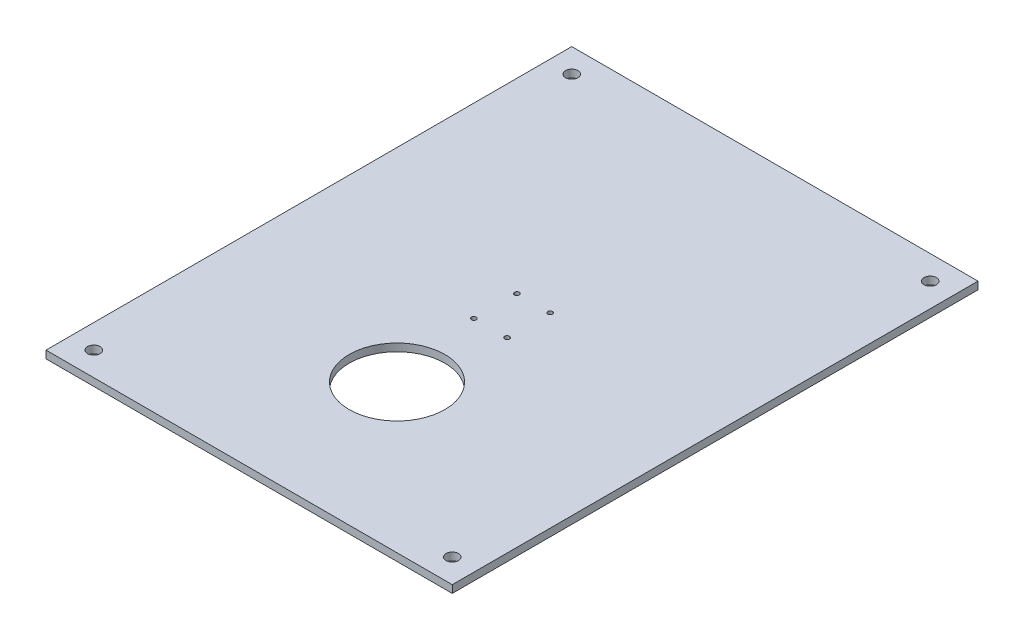
ISO-10303-21;
HEADER;
FILE_DESCRIPTION(('STEP AP214'),'2;1');
FILE_NAME('part.step','',(''),(''),'','','');
FILE_SCHEMA(('AUTOMOTIVE_DESIGN { 1 0 10303 214 1 1 1 1 }'));
ENDSEC;
DATA;
#1=APPLICATION_CONTEXT('core data for automotive mechanical design processes');
#2=APPLICATION_PROTOCOL_DEFINITION('international standard','automotive_design',2000,#1);
#3=PRODUCT_CONTEXT('',#1,'mechanical');
#4=PRODUCT('Part','Part','',(#3));
#5=PRODUCT_RELATED_PRODUCT_CATEGORY('part','',(#4));
#6=PRODUCT_DEFINITION_FORMATION('','',#4);
#7=PRODUCT_DEFINITION_CONTEXT('part definition',#1,'design');
#8=PRODUCT_DEFINITION('design','',#6,#7);
#9=PRODUCT_DEFINITION_SHAPE('','',#8);
#10=(LENGTH_UNIT() NAMED_UNIT(*) SI_UNIT(.MILLI.,.METRE.));
#11=(NAMED_UNIT(*) PLANE_ANGLE_UNIT() SI_UNIT($,.RADIAN.));
#12=(NAMED_UNIT(*) SI_UNIT($,.STERADIAN.) SOLID_ANGLE_UNIT());
#13=UNCERTAINTY_MEASURE_WITH_UNIT(LENGTH_MEASURE(1.E-05),#10,'distance_accuracy_value','');
#14=(GEOMETRIC_REPRESENTATION_CONTEXT(3) GLOBAL_UNCERTAINTY_ASSIGNED_CONTEXT((#13)) GLOBAL_UNIT_ASSIGNED_CONTEXT((#10,
#11,#12)) REPRESENTATION_CONTEXT('',''));
#15=CARTESIAN_POINT('',(0.,0.,0.));
#16=DIRECTION('',(0.,0.,1.));
#17=DIRECTION('',(1.,0.,0.));
#18=AXIS2_PLACEMENT_3D('',#15,#16,#17);
#19=CARTESIAN_POINT('',(0.,3.175,0.));
#20=DIRECTION('',(0.,1.,0.));
#21=DIRECTION('',(0.,0.,1.));
#22=AXIS2_PLACEMENT_3D('',#19,#20,#21);
#23=PLANE('',#22);
#24=CARTESIAN_POINT('',(-6.95454545454543,3.175,9.00000000000001));
#25=DIRECTION('',(0.,1.,0.));
#26=DIRECTION('',(0.,0.,-1.));
#27=AXIS2_PLACEMENT_3D('',#24,#25,#26);
#28=CIRCLE('',#27,1.00000000000001);
#29=CARTESIAN_POINT('',(-6.95454545454543,3.175,8.));
#30=VERTEX_POINT('',#29);
#31=EDGE_CURVE('E172',#30,#30,#28,.T.);
#32=ORIENTED_EDGE('',*,*,#31,.F.);
#33=EDGE_LOOP('',(#32));
#34=FACE_BOUND('',#33,.T.);
#35=CARTESIAN_POINT('',(6.95454545454544,3.175,-8.99999999999999));
#36=DIRECTION('',(0.,1.,0.));
#37=DIRECTION('',(0.,0.,-1.));
#38=AXIS2_PLACEMENT_3D('',#35,#36,#37);
#39=CIRCLE('',#38,0.999999999999998);
#40=CARTESIAN_POINT('',(6.95454545454544,3.175,-9.99999999999999));
#41=VERTEX_POINT('',#40);
#42=EDGE_CURVE('E154',#41,#41,#39,.T.);
#43=ORIENTED_EDGE('',*,*,#42,.F.);
#44=EDGE_LOOP('',(#43));
#45=FACE_BOUND('',#44,.T.);
#46=CARTESIAN_POINT('',(-75.,3.175,100.));
#47=DIRECTION('',(0.,1.,0.));
#48=DIRECTION('',(0.,0.,-1.));
#49=AXIS2_PLACEMENT_3D('',#46,#47,#48);
#50=CIRCLE('',#49,2.59999999999997);
#51=CARTESIAN_POINT('',(-75.,3.175,97.4));
#52=VERTEX_POINT('',#51);
#53=EDGE_CURVE('E139',#52,#52,#50,.T.);
#54=ORIENTED_EDGE('',*,*,#53,.F.);
#55=EDGE_LOOP('',(#54));
#56=FACE_BOUND('',#55,.T.);
#57=CARTESIAN_POINT('',(75.,3.175,-100.));
#58=DIRECTION('',(0.,1.,0.));
#59=DIRECTION('',(0.,0.,-1.));
#60=AXIS2_PLACEMENT_3D('',#57,#58,#59);
#61=CIRCLE('',#60,2.59999999999997);
#62=CARTESIAN_POINT('',(75.,3.175,-102.6));
#63=VERTEX_POINT('',#62);
#64=EDGE_CURVE('E125',#63,#63,#61,.T.);
#65=ORIENTED_EDGE('',*,*,#64,.F.);
#66=EDGE_LOOP('',(#65));
#67=FACE_BOUND('',#66,.T.);
#68=DIRECTION('',(0.,0.,1.));
#69=VECTOR('',#68,1.);
#70=CARTESIAN_POINT('',(-85.,3.175,110.));
#71=LINE('',#70,#69);
#72=CARTESIAN_POINT('',(-85.,3.175,-110.));
#73=VERTEX_POINT('',#72);
#74=CARTESIAN_POINT('',(-85.,3.175,110.));
#75=VERTEX_POINT('',#74);
#76=EDGE_CURVE('E87',#73,#75,#71,.T.);
#77=ORIENTED_EDGE('',*,*,#76,.T.);
#78=DIRECTION('',(1.,0.,0.));
#79=VECTOR('',#78,1.);
#80=CARTESIAN_POINT('',(85.,3.175,110.));
#81=LINE('',#80,#79);
#82=CARTESIAN_POINT('',(85.,3.175,110.));
#83=VERTEX_POINT('',#82);
#84=EDGE_CURVE('E82',#75,#83,#81,.T.);
#85=ORIENTED_EDGE('',*,*,#84,.T.);
#86=DIRECTION('',(0.,0.,-1.));
#87=VECTOR('',#86,1.);
#88=CARTESIAN_POINT('',(85.,3.175,110.));
#89=LINE('',#88,#87);
#90=CARTESIAN_POINT('',(85.,3.175,-110.));
#91=VERTEX_POINT('',#90);
#92=EDGE_CURVE('E85',#83,#91,#89,.T.);
#93=ORIENTED_EDGE('',*,*,#92,.T.);
#94=DIRECTION('',(-1.,0.,0.));
#95=VECTOR('',#94,1.);
#96=CARTESIAN_POINT('',(85.,3.175,-110.));
#97=LINE('',#96,#95);
#98=EDGE_CURVE('E52',#91,#73,#97,.T.);
#99=ORIENTED_EDGE('',*,*,#98,.T.);
#100=EDGE_LOOP('',(#77,#85,#93,#99));
#101=FACE_BOUND('',#100,.T.);
#102=CARTESIAN_POINT('',(-75.,3.175,-100.));
#103=DIRECTION('',(0.,1.,0.));
#104=DIRECTION('',(0.,0.,1.));
#105=AXIS2_PLACEMENT_3D('',#102,#103,#104);
#106=CIRCLE('',#105,2.59999999999997);
#107=CARTESIAN_POINT('',(-75.,3.175,-97.4));
#108=VERTEX_POINT('',#107);
#109=EDGE_CURVE('E114',#108,#108,#106,.T.);
#110=ORIENTED_EDGE('',*,*,#109,.F.);
#111=EDGE_LOOP('',(#110));
#112=FACE_BOUND('',#111,.T.);
#113=CARTESIAN_POINT('',(75.,3.175,100.));
#114=DIRECTION('',(0.,1.,0.));
#115=DIRECTION('',(0.,0.,1.));
#116=AXIS2_PLACEMENT_3D('',#113,#114,#115);
#117=CIRCLE('',#116,2.59999999999997);
#118=CARTESIAN_POINT('',(75.,3.175,102.6));
#119=VERTEX_POINT('',#118);
#120=EDGE_CURVE('E138',#119,#119,#117,.T.);
#121=ORIENTED_EDGE('',*,*,#120,.F.);
#122=EDGE_LOOP('',(#121));
#123=FACE_BOUND('',#122,.T.);
#124=CARTESIAN_POINT('',(-6.95454545454543,3.175,-8.99999999999999));
#125=DIRECTION('',(0.,1.,0.));
#126=DIRECTION('',(0.,0.,1.));
#127=AXIS2_PLACEMENT_3D('',#124,#125,#126);
#128=CIRCLE('',#127,0.999999999999998);
#129=CARTESIAN_POINT('',(-6.95454545454543,3.175,-7.99999999999999));
#130=VERTEX_POINT('',#129);
#131=EDGE_CURVE('E146',#130,#130,#128,.T.);
#132=ORIENTED_EDGE('',*,*,#131,.F.);
#133=EDGE_LOOP('',(#132));
#134=FACE_BOUND('',#133,.T.);
#135=CARTESIAN_POINT('',(6.95454545454544,3.175,9.00000000000001));
#136=DIRECTION('',(0.,1.,0.));
#137=DIRECTION('',(0.,0.,1.));
#138=AXIS2_PLACEMENT_3D('',#135,#136,#137);
#139=CIRCLE('',#138,1.00000000000001);
#140=CARTESIAN_POINT('',(6.95454545454544,3.175,10.));
#141=VERTEX_POINT('',#140);
#142=EDGE_CURVE('E162',#141,#141,#139,.T.);
#143=ORIENTED_EDGE('',*,*,#142,.F.);
#144=EDGE_LOOP('',(#143));
#145=FACE_BOUND('',#144,.T.);
#146=CARTESIAN_POINT('',(0.,3.175,48.117139717732));
#147=DIRECTION('',(0.,1.,0.));
#148=DIRECTION('',(0.,0.,1.));
#149=AXIS2_PLACEMENT_3D('',#146,#147,#148);
#150=CIRCLE('',#149,20.);
#151=CARTESIAN_POINT('',(0.,3.175,68.117139717732));
#152=VERTEX_POINT('',#151);
#153=EDGE_CURVE('E183',#152,#152,#150,.T.);
#154=ORIENTED_EDGE('',*,*,#153,.F.);
#155=EDGE_LOOP('',(#154));
#156=FACE_BOUND('',#155,.T.);
#157=ADVANCED_FACE('F35',(#34,#45,#56,#67,#101,#112,#123,#134,#145,#156),#23,.T.);
#158=CARTESIAN_POINT('',(0.,0.,0.));
#159=DIRECTION('',(0.,1.,0.));
#160=DIRECTION('',(0.,0.,1.));
#161=AXIS2_PLACEMENT_3D('',#158,#159,#160);
#162=PLANE('',#161);
#163=CARTESIAN_POINT('',(-6.95454545454543,0.,9.00000000000001));
#164=DIRECTION('',(0.,1.,0.));
#165=DIRECTION('',(0.,0.,-1.));
#166=AXIS2_PLACEMENT_3D('',#163,#164,#165);
#167=CIRCLE('',#166,1.00000000000001);
#168=CARTESIAN_POINT('',(-6.95454545454543,0.,8.));
#169=VERTEX_POINT('',#168);
#170=EDGE_CURVE('E169',#169,#169,#167,.T.);
#171=ORIENTED_EDGE('',*,*,#170,.T.);
#172=EDGE_LOOP('',(#171));
#173=FACE_BOUND('',#172,.T.);
#174=CARTESIAN_POINT('',(6.95454545454544,0.,-8.99999999999999));
#175=DIRECTION('',(0.,1.,0.));
#176=DIRECTION('',(0.,0.,-1.));
#177=AXIS2_PLACEMENT_3D('',#174,#175,#176);
#178=CIRCLE('',#177,0.999999999999998);
#179=CARTESIAN_POINT('',(6.95454545454544,0.,-9.99999999999999));
#180=VERTEX_POINT('',#179);
#181=EDGE_CURVE('E159',#180,#180,#178,.T.);
#182=ORIENTED_EDGE('',*,*,#181,.T.);
#183=EDGE_LOOP('',(#182));
#184=FACE_BOUND('',#183,.T.);
#185=CARTESIAN_POINT('',(-75.,0.,100.));
#186=DIRECTION('',(0.,1.,0.));
#187=DIRECTION('',(0.,0.,-1.));
#188=AXIS2_PLACEMENT_3D('',#185,#186,#187);
#189=CIRCLE('',#188,2.59999999999997);
#190=CARTESIAN_POINT('',(-75.,0.,97.4));
#191=VERTEX_POINT('',#190);
#192=EDGE_CURVE('E144',#191,#191,#189,.T.);
#193=ORIENTED_EDGE('',*,*,#192,.T.);
#194=EDGE_LOOP('',(#193));
#195=FACE_BOUND('',#194,.T.);
#196=CARTESIAN_POINT('',(75.,0.,-100.));
#197=DIRECTION('',(0.,1.,0.));
#198=DIRECTION('',(0.,0.,-1.));
#199=AXIS2_PLACEMENT_3D('',#196,#197,#198);
#200=CIRCLE('',#199,2.59999999999997);
#201=CARTESIAN_POINT('',(75.,0.,-102.6));
#202=VERTEX_POINT('',#201);
#203=EDGE_CURVE('E122',#202,#202,#200,.T.);
#204=ORIENTED_EDGE('',*,*,#203,.T.);
#205=EDGE_LOOP('',(#204));
#206=FACE_BOUND('',#205,.T.);
#207=DIRECTION('',(0.,0.,1.));
#208=VECTOR('',#207,1.);
#209=CARTESIAN_POINT('',(-85.,0.,110.));
#210=LINE('',#209,#208);
#211=CARTESIAN_POINT('',(-85.,0.,-110.));
#212=VERTEX_POINT('',#211);
#213=CARTESIAN_POINT('',(-85.,0.,110.));
#214=VERTEX_POINT('',#213);
#215=EDGE_CURVE('E120',#212,#214,#210,.T.);
#216=ORIENTED_EDGE('',*,*,#215,.F.);
#217=DIRECTION('',(-1.,0.,0.));
#218=VECTOR('',#217,1.);
#219=CARTESIAN_POINT('',(85.,0.,-110.));
#220=LINE('',#219,#218);
#221=CARTESIAN_POINT('',(85.,0.,-110.));
#222=VERTEX_POINT('',#221);
#223=EDGE_CURVE('E75',#222,#212,#220,.T.);
#224=ORIENTED_EDGE('',*,*,#223,.F.);
#225=DIRECTION('',(0.,0.,-1.));
#226=VECTOR('',#225,1.);
#227=CARTESIAN_POINT('',(85.,0.,110.));
#228=LINE('',#227,#226);
#229=CARTESIAN_POINT('',(85.,0.,110.));
#230=VERTEX_POINT('',#229);
#231=EDGE_CURVE('E69',#230,#222,#228,.T.);
#232=ORIENTED_EDGE('',*,*,#231,.F.);
#233=DIRECTION('',(1.,0.,0.));
#234=VECTOR('',#233,1.);
#235=CARTESIAN_POINT('',(85.,0.,110.));
#236=LINE('',#235,#234);
#237=EDGE_CURVE('E92',#214,#230,#236,.T.);
#238=ORIENTED_EDGE('',*,*,#237,.F.);
#239=EDGE_LOOP('',(#216,#224,#232,#238));
#240=FACE_BOUND('',#239,.T.);
#241=CARTESIAN_POINT('',(-75.,0.,-100.));
#242=DIRECTION('',(0.,1.,0.));
#243=DIRECTION('',(0.,0.,1.));
#244=AXIS2_PLACEMENT_3D('',#241,#242,#243);
#245=CIRCLE('',#244,2.59999999999997);
#246=CARTESIAN_POINT('',(-75.,0.,-97.4));
#247=VERTEX_POINT('',#246);
#248=EDGE_CURVE('E121',#247,#247,#245,.T.);
#249=ORIENTED_EDGE('',*,*,#248,.T.);
#250=EDGE_LOOP('',(#249));
#251=FACE_BOUND('',#250,.T.);
#252=CARTESIAN_POINT('',(75.,0.,100.));
#253=DIRECTION('',(0.,1.,0.));
#254=DIRECTION('',(0.,0.,1.));
#255=AXIS2_PLACEMENT_3D('',#252,#253,#254);
#256=CIRCLE('',#255,2.59999999999997);
#257=CARTESIAN_POINT('',(75.,0.,102.6));
#258=VERTEX_POINT('',#257);
#259=EDGE_CURVE('E136',#258,#258,#256,.T.);
#260=ORIENTED_EDGE('',*,*,#259,.T.);
#261=EDGE_LOOP('',(#260));
#262=FACE_BOUND('',#261,.T.);
#263=CARTESIAN_POINT('',(-6.95454545454543,0.,-8.99999999999999));
#264=DIRECTION('',(0.,1.,0.));
#265=DIRECTION('',(0.,0.,1.));
#266=AXIS2_PLACEMENT_3D('',#263,#264,#265);
#267=CIRCLE('',#266,0.999999999999998);
#268=CARTESIAN_POINT('',(-6.95454545454543,0.,-7.99999999999999));
#269=VERTEX_POINT('',#268);
#270=EDGE_CURVE('E151',#269,#269,#267,.T.);
#271=ORIENTED_EDGE('',*,*,#270,.T.);
#272=EDGE_LOOP('',(#271));
#273=FACE_BOUND('',#272,.T.);
#274=CARTESIAN_POINT('',(6.95454545454544,0.,9.00000000000001));
#275=DIRECTION('',(0.,1.,0.));
#276=DIRECTION('',(0.,0.,1.));
#277=AXIS2_PLACEMENT_3D('',#274,#275,#276);
#278=CIRCLE('',#277,1.00000000000001);
#279=CARTESIAN_POINT('',(6.95454545454544,0.,10.));
#280=VERTEX_POINT('',#279);
#281=EDGE_CURVE('E168',#280,#280,#278,.T.);
#282=ORIENTED_EDGE('',*,*,#281,.T.);
#283=EDGE_LOOP('',(#282));
#284=FACE_BOUND('',#283,.T.);
#285=CARTESIAN_POINT('',(0.,0.,48.117139717732));
#286=DIRECTION('',(0.,1.,0.));
#287=DIRECTION('',(0.,0.,1.));
#288=AXIS2_PLACEMENT_3D('',#285,#286,#287);
#289=CIRCLE('',#288,20.);
#290=CARTESIAN_POINT('',(0.,0.,68.117139717732));
#291=VERTEX_POINT('',#290);
#292=EDGE_CURVE('E181',#291,#291,#289,.T.);
#293=ORIENTED_EDGE('',*,*,#292,.T.);
#294=EDGE_LOOP('',(#293));
#295=FACE_BOUND('',#294,.T.);
#296=ADVANCED_FACE('F192',(#173,#184,#195,#206,#240,#251,#262,#273,#284,#295),#162,.F.);
#297=CARTESIAN_POINT('',(-85.,3.175,110.));
#298=DIRECTION('',(1.,0.,0.));
#299=DIRECTION('',(0.,0.,-1.));
#300=AXIS2_PLACEMENT_3D('',#297,#298,#299);
#301=PLANE('',#300);
#302=ORIENTED_EDGE('',*,*,#215,.T.);
#303=DIRECTION('',(0.,-1.,0.));
#304=VECTOR('',#303,1.);
#305=CARTESIAN_POINT('',(-85.,3.175,110.));
#306=LINE('',#305,#304);
#307=EDGE_CURVE('E12',#75,#214,#306,.T.);
#308=ORIENTED_EDGE('',*,*,#307,.F.);
#309=ORIENTED_EDGE('',*,*,#76,.F.);
#310=DIRECTION('',(0.,-1.,0.));
#311=VECTOR('',#310,1.);
#312=CARTESIAN_POINT('',(-85.,3.175,-110.));
#313=LINE('',#312,#311);
#314=EDGE_CURVE('E98',#73,#212,#313,.T.);
#315=ORIENTED_EDGE('',*,*,#314,.T.);
#316=EDGE_LOOP('',(#302,#308,#309,#315));
#317=FACE_BOUND('',#316,.T.);
#318=ADVANCED_FACE('F37',(#317),#301,.F.);
#319=CARTESIAN_POINT('',(85.,3.175,110.));
#320=DIRECTION('',(0.,0.,-1.));
#321=DIRECTION('',(-1.,0.,0.));
#322=AXIS2_PLACEMENT_3D('',#319,#320,#321);
#323=PLANE('',#322);
#324=ORIENTED_EDGE('',*,*,#237,.T.);
#325=DIRECTION('',(0.,-1.,0.));
#326=VECTOR('',#325,1.);
#327=CARTESIAN_POINT('',(85.,3.175,110.));
#328=LINE('',#327,#326);
#329=EDGE_CURVE('E44',#83,#230,#328,.T.);
#330=ORIENTED_EDGE('',*,*,#329,.F.);
#331=ORIENTED_EDGE('',*,*,#84,.F.);
#332=ORIENTED_EDGE('',*,*,#307,.T.);
#333=EDGE_LOOP('',(#324,#330,#331,#332));
#334=FACE_BOUND('',#333,.T.);
#335=ADVANCED_FACE('F91',(#334),#323,.F.);
#336=CARTESIAN_POINT('',(85.,3.175,110.));
#337=DIRECTION('',(-1.,0.,0.));
#338=DIRECTION('',(0.,0.,1.));
#339=AXIS2_PLACEMENT_3D('',#336,#337,#338);
#340=PLANE('',#339);
#341=ORIENTED_EDGE('',*,*,#231,.T.);
#342=DIRECTION('',(0.,-1.,0.));
#343=VECTOR('',#342,1.);
#344=CARTESIAN_POINT('',(85.,3.175,-110.));
#345=LINE('',#344,#343);
#346=EDGE_CURVE('E93',#91,#222,#345,.T.);
#347=ORIENTED_EDGE('',*,*,#346,.F.);
#348=ORIENTED_EDGE('',*,*,#92,.F.);
#349=ORIENTED_EDGE('',*,*,#329,.T.);
#350=EDGE_LOOP('',(#341,#347,#348,#349));
#351=FACE_BOUND('',#350,.T.);
#352=ADVANCED_FACE('F94',(#351),#340,.F.);
#353=CARTESIAN_POINT('',(85.,3.175,-110.));
#354=DIRECTION('',(0.,0.,1.));
#355=DIRECTION('',(1.,0.,0.));
#356=AXIS2_PLACEMENT_3D('',#353,#354,#355);
#357=PLANE('',#356);
#358=ORIENTED_EDGE('',*,*,#223,.T.);
#359=ORIENTED_EDGE('',*,*,#314,.F.);
#360=ORIENTED_EDGE('',*,*,#98,.F.);
#361=ORIENTED_EDGE('',*,*,#346,.T.);
#362=EDGE_LOOP('',(#358,#359,#360,#361));
#363=FACE_BOUND('',#362,.T.);
#364=ADVANCED_FACE('F222',(#363),#357,.F.);
#365=CARTESIAN_POINT('',(-75.,3.175,-100.));
#366=DIRECTION('',(0.,-1.,0.));
#367=DIRECTION('',(0.,0.,-1.));
#368=AXIS2_PLACEMENT_3D('',#365,#366,#367);
#369=CYLINDRICAL_SURFACE('',#368,2.59999999999997);
#370=ORIENTED_EDGE('',*,*,#109,.T.);
#371=EDGE_LOOP('',(#370));
#372=FACE_BOUND('',#371,.T.);
#373=ORIENTED_EDGE('',*,*,#248,.F.);
#374=EDGE_LOOP('',(#373));
#375=FACE_BOUND('',#374,.T.);
#376=ADVANCED_FACE('F219',(#372,#375),#369,.F.);
#377=CARTESIAN_POINT('',(75.,3.175,-100.));
#378=DIRECTION('',(0.,-1.,0.));
#379=DIRECTION('',(0.,0.,-1.));
#380=AXIS2_PLACEMENT_3D('',#377,#378,#379);
#381=CYLINDRICAL_SURFACE('',#380,2.59999999999997);
#382=ORIENTED_EDGE('',*,*,#64,.T.);
#383=EDGE_LOOP('',(#382));
#384=FACE_BOUND('',#383,.T.);
#385=ORIENTED_EDGE('',*,*,#203,.F.);
#386=EDGE_LOOP('',(#385));
#387=FACE_BOUND('',#386,.T.);
#388=ADVANCED_FACE('F270',(#384,#387),#381,.F.);
#389=CARTESIAN_POINT('',(75.,3.175,100.));
#390=DIRECTION('',(0.,-1.,0.));
#391=DIRECTION('',(0.,0.,-1.));
#392=AXIS2_PLACEMENT_3D('',#389,#390,#391);
#393=CYLINDRICAL_SURFACE('',#392,2.59999999999997);
#394=ORIENTED_EDGE('',*,*,#120,.T.);
#395=EDGE_LOOP('',(#394));
#396=FACE_BOUND('',#395,.T.);
#397=ORIENTED_EDGE('',*,*,#259,.F.);
#398=EDGE_LOOP('',(#397));
#399=FACE_BOUND('',#398,.T.);
#400=ADVANCED_FACE('F265',(#396,#399),#393,.F.);
#401=CARTESIAN_POINT('',(-75.,3.175,100.));
#402=DIRECTION('',(0.,-1.,0.));
#403=DIRECTION('',(0.,0.,-1.));
#404=AXIS2_PLACEMENT_3D('',#401,#402,#403);
#405=CYLINDRICAL_SURFACE('',#404,2.59999999999997);
#406=ORIENTED_EDGE('',*,*,#53,.T.);
#407=EDGE_LOOP('',(#406));
#408=FACE_BOUND('',#407,.T.);
#409=ORIENTED_EDGE('',*,*,#192,.F.);
#410=EDGE_LOOP('',(#409));
#411=FACE_BOUND('',#410,.T.);
#412=ADVANCED_FACE('F256',(#408,#411),#405,.F.);
#413=CARTESIAN_POINT('',(-6.95454545454543,3.175,-8.99999999999999));
#414=DIRECTION('',(0.,-1.,0.));
#415=DIRECTION('',(0.,0.,-1.));
#416=AXIS2_PLACEMENT_3D('',#413,#414,#415);
#417=CYLINDRICAL_SURFACE('',#416,0.999999999999998);
#418=ORIENTED_EDGE('',*,*,#131,.T.);
#419=EDGE_LOOP('',(#418));
#420=FACE_BOUND('',#419,.T.);
#421=ORIENTED_EDGE('',*,*,#270,.F.);
#422=EDGE_LOOP('',(#421));
#423=FACE_BOUND('',#422,.T.);
#424=ADVANCED_FACE('F254',(#420,#423),#417,.F.);
#425=CARTESIAN_POINT('',(6.95454545454544,3.175,-8.99999999999999));
#426=DIRECTION('',(0.,-1.,0.));
#427=DIRECTION('',(0.,0.,-1.));
#428=AXIS2_PLACEMENT_3D('',#425,#426,#427);
#429=CYLINDRICAL_SURFACE('',#428,0.999999999999998);
#430=ORIENTED_EDGE('',*,*,#42,.T.);
#431=EDGE_LOOP('',(#430));
#432=FACE_BOUND('',#431,.T.);
#433=ORIENTED_EDGE('',*,*,#181,.F.);
#434=EDGE_LOOP('',(#433));
#435=FACE_BOUND('',#434,.T.);
#436=ADVANCED_FACE('F206',(#432,#435),#429,.F.);
#437=CARTESIAN_POINT('',(6.95454545454544,3.175,9.00000000000001));
#438=DIRECTION('',(0.,-1.,0.));
#439=DIRECTION('',(0.,0.,-1.));
#440=AXIS2_PLACEMENT_3D('',#437,#438,#439);
#441=CYLINDRICAL_SURFACE('',#440,1.00000000000001);
#442=ORIENTED_EDGE('',*,*,#142,.T.);
#443=EDGE_LOOP('',(#442));
#444=FACE_BOUND('',#443,.T.);
#445=ORIENTED_EDGE('',*,*,#281,.F.);
#446=EDGE_LOOP('',(#445));
#447=FACE_BOUND('',#446,.T.);
#448=ADVANCED_FACE('F198',(#444,#447),#441,.F.);
#449=CARTESIAN_POINT('',(-6.95454545454543,3.175,9.00000000000001));
#450=DIRECTION('',(0.,-1.,0.));
#451=DIRECTION('',(0.,0.,-1.));
#452=AXIS2_PLACEMENT_3D('',#449,#450,#451);
#453=CYLINDRICAL_SURFACE('',#452,1.00000000000001);
#454=ORIENTED_EDGE('',*,*,#31,.T.);
#455=EDGE_LOOP('',(#454));
#456=FACE_BOUND('',#455,.T.);
#457=ORIENTED_EDGE('',*,*,#170,.F.);
#458=EDGE_LOOP('',(#457));
#459=FACE_BOUND('',#458,.T.);
#460=ADVANCED_FACE('F195',(#456,#459),#453,.F.);
#461=CARTESIAN_POINT('',(0.,3.175,48.117139717732));
#462=DIRECTION('',(0.,-1.,0.));
#463=DIRECTION('',(0.,0.,-1.));
#464=AXIS2_PLACEMENT_3D('',#461,#462,#463);
#465=CYLINDRICAL_SURFACE('',#464,20.);
#466=ORIENTED_EDGE('',*,*,#153,.T.);
#467=EDGE_LOOP('',(#466));
#468=FACE_BOUND('',#467,.T.);
#469=ORIENTED_EDGE('',*,*,#292,.F.);
#470=EDGE_LOOP('',(#469));
#471=FACE_BOUND('',#470,.T.);
#472=ADVANCED_FACE('F197',(#468,#471),#465,.F.);
#473=CLOSED_SHELL('',(#157,#296,#318,#335,#352,#364,#376,#388,#400,#412,#424,#436,#448,#460,#472));
#474=MANIFOLD_SOLID_BREP('B2',#473);
#475=ADVANCED_BREP_SHAPE_REPRESENTATION('',(#18,#474),#14);
#476=SHAPE_DEFINITION_REPRESENTATION(#9,#475);
ENDSEC;
END-ISO-10303-21;
